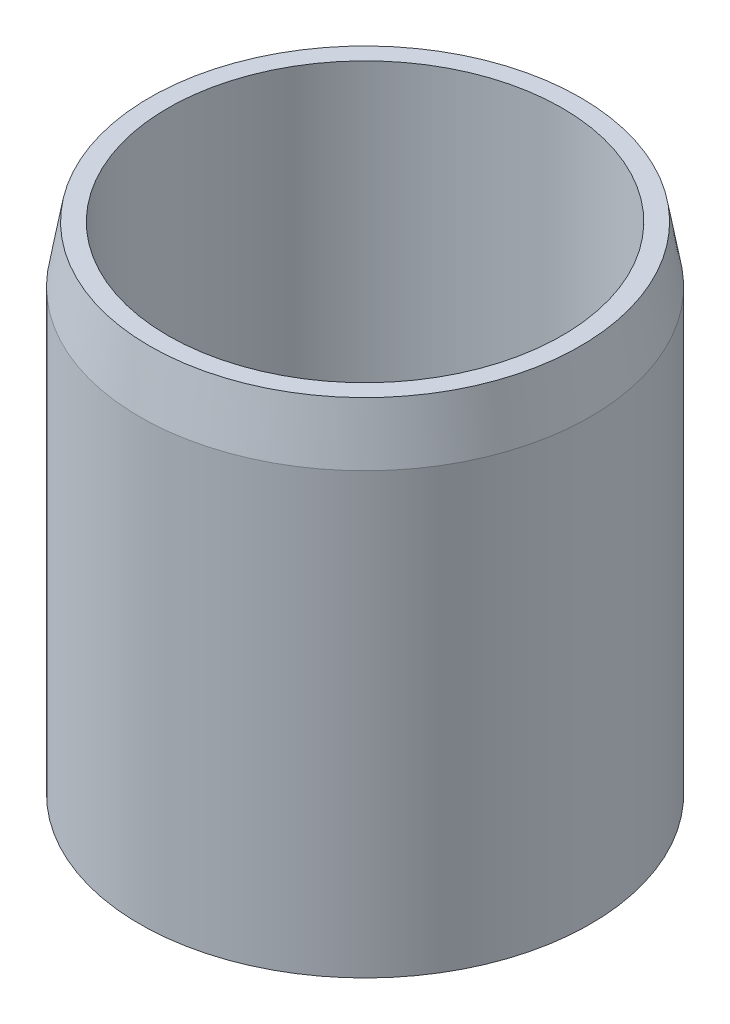
ISO-10303-21;
HEADER;
FILE_DESCRIPTION(('STEP AP214'),'2;1');
FILE_NAME('part.step','',(''),(''),'','','');
FILE_SCHEMA(('AUTOMOTIVE_DESIGN { 1 0 10303 214 1 1 1 1 }'));
ENDSEC;
DATA;
#1=APPLICATION_CONTEXT('core data for automotive mechanical design processes');
#2=APPLICATION_PROTOCOL_DEFINITION('international standard','automotive_design',2000,#1);
#3=PRODUCT_CONTEXT('',#1,'mechanical');
#4=PRODUCT('Part','Part','',(#3));
#5=PRODUCT_RELATED_PRODUCT_CATEGORY('part','',(#4));
#6=PRODUCT_DEFINITION_FORMATION('','',#4);
#7=PRODUCT_DEFINITION_CONTEXT('part definition',#1,'design');
#8=PRODUCT_DEFINITION('design','',#6,#7);
#9=PRODUCT_DEFINITION_SHAPE('','',#8);
#10=(LENGTH_UNIT() NAMED_UNIT(*) SI_UNIT(.MILLI.,.METRE.));
#11=(NAMED_UNIT(*) PLANE_ANGLE_UNIT() SI_UNIT($,.RADIAN.));
#12=(NAMED_UNIT(*) SI_UNIT($,.STERADIAN.) SOLID_ANGLE_UNIT());
#13=UNCERTAINTY_MEASURE_WITH_UNIT(LENGTH_MEASURE(1.E-05),#10,'distance_accuracy_value','');
#14=(GEOMETRIC_REPRESENTATION_CONTEXT(3) GLOBAL_UNCERTAINTY_ASSIGNED_CONTEXT((#13)) GLOBAL_UNIT_ASSIGNED_CONTEXT((#10,
#11,#12)) REPRESENTATION_CONTEXT('',''));
#15=CARTESIAN_POINT('',(0.,0.,0.));
#16=DIRECTION('',(0.,0.,1.));
#17=DIRECTION('',(1.,0.,0.));
#18=AXIS2_PLACEMENT_3D('',#15,#16,#17);
#19=CARTESIAN_POINT('',(0.,8.8,-4.));
#20=DIRECTION('',(0.,1.,0.));
#21=DIRECTION('',(0.,0.,1.));
#22=AXIS2_PLACEMENT_3D('',#19,#20,#21);
#23=PLANE('',#22);
#24=CARTESIAN_POINT('',(0.,8.8,0.));
#25=DIRECTION('',(0.,-1.,0.));
#26=DIRECTION('',(0.,0.,-1.));
#27=AXIS2_PLACEMENT_3D('',#24,#25,#26);
#28=CIRCLE('',#27,3.5);
#29=CARTESIAN_POINT('',(0.,8.8,-3.5));
#30=VERTEX_POINT('',#29);
#31=EDGE_CURVE('E17',#30,#30,#28,.T.);
#32=ORIENTED_EDGE('',*,*,#31,.T.);
#33=EDGE_LOOP('',(#32));
#34=FACE_BOUND('',#33,.T.);
#35=CARTESIAN_POINT('',(0.,8.80000000000791,0.));
#36=DIRECTION('',(0.,-1.,0.));
#37=DIRECTION('',(0.,0.,-1.));
#38=AXIS2_PLACEMENT_3D('',#35,#36,#37);
#39=CIRCLE('',#38,3.82367301929776);
#40=CARTESIAN_POINT('',(0.,8.80000000000791,-3.82367301929776));
#41=VERTEX_POINT('',#40);
#42=EDGE_CURVE('E30',#41,#41,#39,.T.);
#43=ORIENTED_EDGE('',*,*,#42,.F.);
#44=EDGE_LOOP('',(#43));
#45=FACE_BOUND('',#44,.T.);
#46=ADVANCED_FACE('F14',(#34,#45),#23,.T.);
#47=CARTESIAN_POINT('',(0.,0.,0.));
#48=DIRECTION('',(0.,-1.,0.));
#49=DIRECTION('',(0.,0.,-1.));
#50=AXIS2_PLACEMENT_3D('',#47,#48,#49);
#51=CYLINDRICAL_SURFACE('',#50,3.5);
#52=CARTESIAN_POINT('',(0.,0.,0.));
#53=DIRECTION('',(0.,-1.,0.));
#54=DIRECTION('',(0.,0.,-1.));
#55=AXIS2_PLACEMENT_3D('',#52,#53,#54);
#56=CIRCLE('',#55,3.5);
#57=CARTESIAN_POINT('',(0.,0.,-3.5));
#58=VERTEX_POINT('',#57);
#59=EDGE_CURVE('E26',#58,#58,#56,.F.);
#60=ORIENTED_EDGE('',*,*,#59,.F.);
#61=EDGE_LOOP('',(#60));
#62=FACE_BOUND('',#61,.T.);
#63=ORIENTED_EDGE('',*,*,#31,.F.);
#64=EDGE_LOOP('',(#63));
#65=FACE_BOUND('',#64,.T.);
#66=ADVANCED_FACE('F39',(#62,#65),#51,.F.);
#67=CARTESIAN_POINT('',(0.,7.80000000003156,0.));
#68=DIRECTION('',(0.,-1.,0.));
#69=DIRECTION('',(0.,0.,-1.));
#70=AXIS2_PLACEMENT_3D('',#67,#68,#69);
#71=CONICAL_SURFACE('',#70,3.99999999999068,0.174532925188401);
#72=CARTESIAN_POINT('',(0.,7.79999999999999,0.));
#73=DIRECTION('',(0.,-1.,0.));
#74=DIRECTION('',(0.,0.,-1.));
#75=AXIS2_PLACEMENT_3D('',#72,#73,#74);
#76=CIRCLE('',#75,4.);
#77=CARTESIAN_POINT('',(0.,7.79999999999999,-4.));
#78=VERTEX_POINT('',#77);
#79=EDGE_CURVE('E21',#78,#78,#76,.T.);
#80=ORIENTED_EDGE('',*,*,#79,.F.);
#81=EDGE_LOOP('',(#80));
#82=FACE_BOUND('',#81,.T.);
#83=ORIENTED_EDGE('',*,*,#42,.T.);
#84=EDGE_LOOP('',(#83));
#85=FACE_BOUND('',#84,.T.);
#86=ADVANCED_FACE('F41',(#82,#85),#71,.T.);
#87=CARTESIAN_POINT('',(0.,0.,-3.5));
#88=DIRECTION('',(0.,-1.,0.));
#89=DIRECTION('',(0.,0.,-1.));
#90=AXIS2_PLACEMENT_3D('',#87,#88,#89);
#91=PLANE('',#90);
#92=ORIENTED_EDGE('',*,*,#59,.T.);
#93=EDGE_LOOP('',(#92));
#94=FACE_BOUND('',#93,.T.);
#95=CARTESIAN_POINT('',(0.,0.,0.));
#96=DIRECTION('',(0.,-1.,0.));
#97=DIRECTION('',(0.,0.,-1.));
#98=AXIS2_PLACEMENT_3D('',#95,#96,#97);
#99=CIRCLE('',#98,4.);
#100=CARTESIAN_POINT('',(0.,0.,-4.));
#101=VERTEX_POINT('',#100);
#102=EDGE_CURVE('E9',#101,#101,#99,.F.);
#103=ORIENTED_EDGE('',*,*,#102,.F.);
#104=EDGE_LOOP('',(#103));
#105=FACE_BOUND('',#104,.T.);
#106=ADVANCED_FACE('F48',(#94,#105),#91,.T.);
#107=CARTESIAN_POINT('',(0.,0.,0.));
#108=DIRECTION('',(0.,-1.,0.));
#109=DIRECTION('',(0.,0.,-1.));
#110=AXIS2_PLACEMENT_3D('',#107,#108,#109);
#111=CYLINDRICAL_SURFACE('',#110,4.);
#112=ORIENTED_EDGE('',*,*,#102,.T.);
#113=EDGE_LOOP('',(#112));
#114=FACE_BOUND('',#113,.T.);
#115=ORIENTED_EDGE('',*,*,#79,.T.);
#116=EDGE_LOOP('',(#115));
#117=FACE_BOUND('',#116,.T.);
#118=ADVANCED_FACE('F52',(#114,#117),#111,.T.);
#119=CLOSED_SHELL('',(#46,#66,#86,#106,#118));
#120=MANIFOLD_SOLID_BREP('B1',#119);
#121=ADVANCED_BREP_SHAPE_REPRESENTATION('',(#18,#120),#14);
#122=SHAPE_DEFINITION_REPRESENTATION(#9,#121);
ENDSEC;
END-ISO-10303-21;
